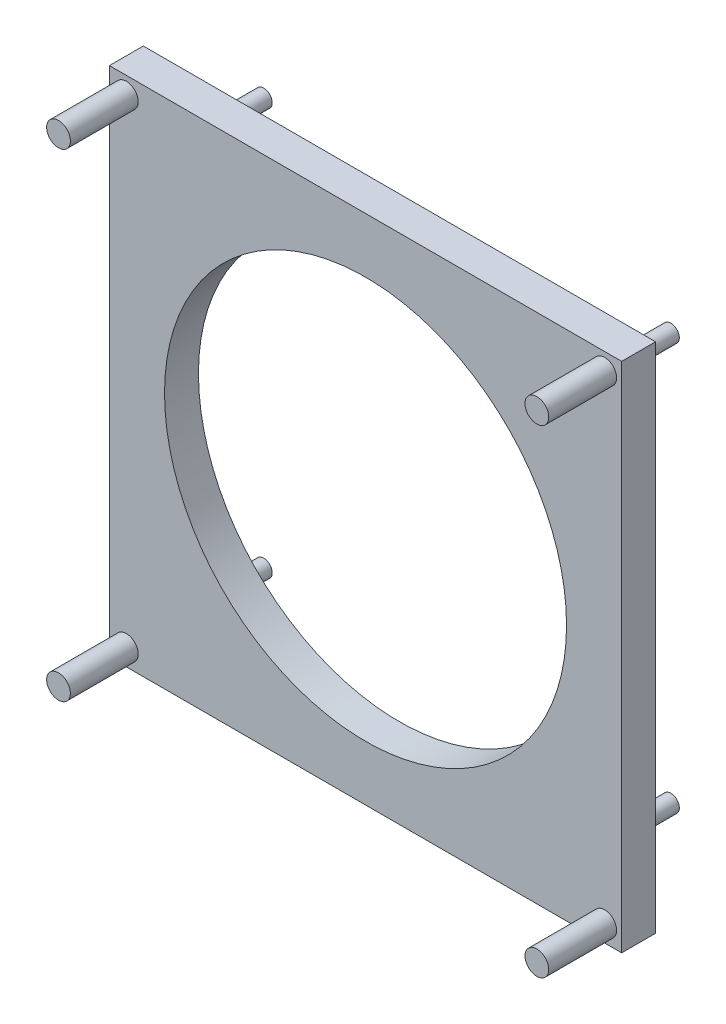
ISO-10303-21;
HEADER;
FILE_DESCRIPTION(('STEP AP214'),'2;1');
FILE_NAME('part.step','',(''),(''),'','','');
FILE_SCHEMA(('AUTOMOTIVE_DESIGN { 1 0 10303 214 1 1 1 1 }'));
ENDSEC;
DATA;
#1=APPLICATION_CONTEXT('core data for automotive mechanical design processes');
#2=APPLICATION_PROTOCOL_DEFINITION('international standard','automotive_design',2000,#1);
#3=PRODUCT_CONTEXT('',#1,'mechanical');
#4=PRODUCT('Part','Part','',(#3));
#5=PRODUCT_RELATED_PRODUCT_CATEGORY('part','',(#4));
#6=PRODUCT_DEFINITION_FORMATION('','',#4);
#7=PRODUCT_DEFINITION_CONTEXT('part definition',#1,'design');
#8=PRODUCT_DEFINITION('design','',#6,#7);
#9=PRODUCT_DEFINITION_SHAPE('','',#8);
#10=(LENGTH_UNIT() NAMED_UNIT(*) SI_UNIT(.MILLI.,.METRE.));
#11=(NAMED_UNIT(*) PLANE_ANGLE_UNIT() SI_UNIT($,.RADIAN.));
#12=(NAMED_UNIT(*) SI_UNIT($,.STERADIAN.) SOLID_ANGLE_UNIT());
#13=UNCERTAINTY_MEASURE_WITH_UNIT(LENGTH_MEASURE(1.E-05),#10,'distance_accuracy_value','');
#14=(GEOMETRIC_REPRESENTATION_CONTEXT(3) GLOBAL_UNCERTAINTY_ASSIGNED_CONTEXT((#13)) GLOBAL_UNIT_ASSIGNED_CONTEXT((#10,
#11,#12)) REPRESENTATION_CONTEXT('',''));
#15=CARTESIAN_POINT('',(0.,0.,0.));
#16=DIRECTION('',(0.,0.,1.));
#17=DIRECTION('',(1.,0.,0.));
#18=AXIS2_PLACEMENT_3D('',#15,#16,#17);
#19=CARTESIAN_POINT('',(-74.7582241985561,-22.7482461751393,0.));
#20=DIRECTION('',(0.,0.,1.));
#21=DIRECTION('',(1.,0.,0.));
#22=AXIS2_PLACEMENT_3D('',#19,#20,#21);
#23=PLANE('',#22);
#24=CARTESIAN_POINT('',(-210.258224198556,112.751753824861,0.));
#25=DIRECTION('',(0.,0.,1.));
#26=DIRECTION('',(1.,0.,0.));
#27=AXIS2_PLACEMENT_3D('',#24,#25,#26);
#28=CIRCLE('',#27,2.5);
#29=CARTESIAN_POINT('',(-207.758224198556,112.751753824861,0.));
#30=VERTEX_POINT('',#29);
#31=EDGE_CURVE('E42',#30,#30,#28,.F.);
#32=ORIENTED_EDGE('',*,*,#31,.F.);
#33=EDGE_LOOP('',(#32));
#34=FACE_BOUND('',#33,.T.);
#35=CARTESIAN_POINT('',(-90.258224198556,-7.24824617513933,0.));
#36=DIRECTION('',(0.,0.,1.));
#37=DIRECTION('',(1.,0.,0.));
#38=AXIS2_PLACEMENT_3D('',#35,#36,#37);
#39=CIRCLE('',#38,2.5);
#40=CARTESIAN_POINT('',(-87.758224198556,-7.24824617513933,0.));
#41=VERTEX_POINT('',#40);
#42=EDGE_CURVE('E112',#41,#41,#39,.F.);
#43=ORIENTED_EDGE('',*,*,#42,.F.);
#44=EDGE_LOOP('',(#43));
#45=FACE_BOUND('',#44,.T.);
#46=CARTESIAN_POINT('',(-150.258224198556,52.7517538248607,0.));
#47=DIRECTION('',(0.,0.,1.));
#48=DIRECTION('',(1.,0.,0.));
#49=AXIS2_PLACEMENT_3D('',#46,#47,#48);
#50=CIRCLE('',#49,59.25);
#51=CARTESIAN_POINT('',(-91.0082241985561,52.7517538248607,0.));
#52=VERTEX_POINT('',#51);
#53=EDGE_CURVE('E105',#52,#52,#50,.T.);
#54=ORIENTED_EDGE('',*,*,#53,.T.);
#55=EDGE_LOOP('',(#54));
#56=FACE_BOUND('',#55,.T.);
#57=DIRECTION('',(0.,1.,0.));
#58=VECTOR('',#57,1.);
#59=CARTESIAN_POINT('',(-74.7582241985561,128.251753824861,0.));
#60=LINE('',#59,#58);
#61=CARTESIAN_POINT('',(-74.758224198556,-22.7482461751393,0.));
#62=VERTEX_POINT('',#61);
#63=CARTESIAN_POINT('',(-74.7582241985561,128.251753824861,0.));
#64=VERTEX_POINT('',#63);
#65=EDGE_CURVE('E102',#62,#64,#60,.T.);
#66=ORIENTED_EDGE('',*,*,#65,.F.);
#67=DIRECTION('',(1.,0.,0.));
#68=VECTOR('',#67,1.);
#69=CARTESIAN_POINT('',(-225.758224198556,-22.7482461751393,0.));
#70=LINE('',#69,#68);
#71=CARTESIAN_POINT('',(-225.758224198556,-22.7482461751393,0.));
#72=VERTEX_POINT('',#71);
#73=EDGE_CURVE('E73',#72,#62,#70,.T.);
#74=ORIENTED_EDGE('',*,*,#73,.F.);
#75=DIRECTION('',(0.,-1.,0.));
#76=VECTOR('',#75,1.);
#77=CARTESIAN_POINT('',(-225.758224198556,128.251753824861,0.));
#78=LINE('',#77,#76);
#79=CARTESIAN_POINT('',(-225.758224198556,128.251753824861,0.));
#80=VERTEX_POINT('',#79);
#81=EDGE_CURVE('E67',#80,#72,#78,.T.);
#82=ORIENTED_EDGE('',*,*,#81,.F.);
#83=DIRECTION('',(-1.,0.,0.));
#84=VECTOR('',#83,1.);
#85=CARTESIAN_POINT('',(-225.758224198556,128.251753824861,0.));
#86=LINE('',#85,#84);
#87=EDGE_CURVE('E92',#64,#80,#86,.T.);
#88=ORIENTED_EDGE('',*,*,#87,.F.);
#89=EDGE_LOOP('',(#66,#74,#82,#88));
#90=FACE_BOUND('',#89,.T.);
#91=CARTESIAN_POINT('',(-90.258224198556,112.751753824861,0.));
#92=DIRECTION('',(0.,0.,1.));
#93=DIRECTION('',(1.,0.,0.));
#94=AXIS2_PLACEMENT_3D('',#91,#92,#93);
#95=CIRCLE('',#94,2.5);
#96=CARTESIAN_POINT('',(-87.758224198556,112.751753824861,0.));
#97=VERTEX_POINT('',#96);
#98=EDGE_CURVE('E115',#97,#97,#95,.F.);
#99=ORIENTED_EDGE('',*,*,#98,.F.);
#100=EDGE_LOOP('',(#99));
#101=FACE_BOUND('',#100,.T.);
#102=CARTESIAN_POINT('',(-210.258224198556,-7.24824617513932,0.));
#103=DIRECTION('',(0.,0.,1.));
#104=DIRECTION('',(1.,0.,0.));
#105=AXIS2_PLACEMENT_3D('',#102,#103,#104);
#106=CIRCLE('',#105,2.5);
#107=CARTESIAN_POINT('',(-207.758224198556,-7.24824617513932,0.));
#108=VERTEX_POINT('',#107);
#109=EDGE_CURVE('E11',#108,#108,#106,.F.);
#110=ORIENTED_EDGE('',*,*,#109,.F.);
#111=EDGE_LOOP('',(#110));
#112=FACE_BOUND('',#111,.T.);
#113=ADVANCED_FACE('F33',(#34,#45,#56,#90,#101,#112),#23,.F.);
#114=CARTESIAN_POINT('',(-74.7582241985561,-22.7482461751393,10.));
#115=DIRECTION('',(0.,0.,1.));
#116=DIRECTION('',(1.,0.,0.));
#117=AXIS2_PLACEMENT_3D('',#114,#115,#116);
#118=PLANE('',#117);
#119=CARTESIAN_POINT('',(-79.758224198556,123.251753824861,10.));
#120=DIRECTION('',(0.,0.,1.));
#121=DIRECTION('',(1.,0.,0.));
#122=AXIS2_PLACEMENT_3D('',#119,#120,#121);
#123=CIRCLE('',#122,3.50000000000001);
#124=CARTESIAN_POINT('',(-76.258224198556,123.251753824861,10.));
#125=VERTEX_POINT('',#124);
#126=EDGE_CURVE('E239',#125,#125,#123,.T.);
#127=ORIENTED_EDGE('',*,*,#126,.F.);
#128=EDGE_LOOP('',(#127));
#129=FACE_BOUND('',#128,.T.);
#130=CARTESIAN_POINT('',(-79.758224198556,-17.7482461751393,10.));
#131=DIRECTION('',(0.,0.,1.));
#132=DIRECTION('',(1.,0.,0.));
#133=AXIS2_PLACEMENT_3D('',#130,#131,#132);
#134=CIRCLE('',#133,3.50000000000001);
#135=CARTESIAN_POINT('',(-76.258224198556,-17.7482461751393,10.));
#136=VERTEX_POINT('',#135);
#137=EDGE_CURVE('E227',#136,#136,#134,.T.);
#138=ORIENTED_EDGE('',*,*,#137,.F.);
#139=EDGE_LOOP('',(#138));
#140=FACE_BOUND('',#139,.T.);
#141=CARTESIAN_POINT('',(-150.258224198556,52.7517538248607,10.));
#142=DIRECTION('',(0.,0.,1.));
#143=DIRECTION('',(1.,0.,0.));
#144=AXIS2_PLACEMENT_3D('',#141,#142,#143);
#145=CIRCLE('',#144,59.25);
#146=CARTESIAN_POINT('',(-91.0082241985561,52.7517538248607,10.));
#147=VERTEX_POINT('',#146);
#148=EDGE_CURVE('E222',#147,#147,#145,.T.);
#149=ORIENTED_EDGE('',*,*,#148,.F.);
#150=EDGE_LOOP('',(#149));
#151=FACE_BOUND('',#150,.T.);
#152=DIRECTION('',(0.,1.,0.));
#153=VECTOR('',#152,1.);
#154=CARTESIAN_POINT('',(-74.7582241985561,128.251753824861,10.));
#155=LINE('',#154,#153);
#156=CARTESIAN_POINT('',(-74.758224198556,-22.7482461751393,10.));
#157=VERTEX_POINT('',#156);
#158=CARTESIAN_POINT('',(-74.7582241985561,128.251753824861,10.));
#159=VERTEX_POINT('',#158);
#160=EDGE_CURVE('E87',#157,#159,#155,.T.);
#161=ORIENTED_EDGE('',*,*,#160,.T.);
#162=DIRECTION('',(-1.,0.,0.));
#163=VECTOR('',#162,1.);
#164=CARTESIAN_POINT('',(-225.758224198556,128.251753824861,10.));
#165=LINE('',#164,#163);
#166=CARTESIAN_POINT('',(-225.758224198556,128.251753824861,10.));
#167=VERTEX_POINT('',#166);
#168=EDGE_CURVE('E81',#159,#167,#165,.T.);
#169=ORIENTED_EDGE('',*,*,#168,.T.);
#170=DIRECTION('',(0.,-1.,0.));
#171=VECTOR('',#170,1.);
#172=CARTESIAN_POINT('',(-225.758224198556,128.251753824861,10.));
#173=LINE('',#172,#171);
#174=CARTESIAN_POINT('',(-225.758224198556,-22.7482461751393,10.));
#175=VERTEX_POINT('',#174);
#176=EDGE_CURVE('E85',#167,#175,#173,.T.);
#177=ORIENTED_EDGE('',*,*,#176,.T.);
#178=DIRECTION('',(1.,0.,0.));
#179=VECTOR('',#178,1.);
#180=CARTESIAN_POINT('',(-225.758224198556,-22.7482461751393,10.));
#181=LINE('',#180,#179);
#182=EDGE_CURVE('E50',#175,#157,#181,.T.);
#183=ORIENTED_EDGE('',*,*,#182,.T.);
#184=EDGE_LOOP('',(#161,#169,#177,#183));
#185=FACE_BOUND('',#184,.T.);
#186=CARTESIAN_POINT('',(-220.758224198556,-17.7482461751393,10.));
#187=DIRECTION('',(0.,0.,1.));
#188=DIRECTION('',(1.,0.,0.));
#189=AXIS2_PLACEMENT_3D('',#186,#187,#188);
#190=CIRCLE('',#189,3.49999999999999);
#191=CARTESIAN_POINT('',(-217.258224198556,-17.7482461751393,10.));
#192=VERTEX_POINT('',#191);
#193=EDGE_CURVE('E233',#192,#192,#190,.T.);
#194=ORIENTED_EDGE('',*,*,#193,.F.);
#195=EDGE_LOOP('',(#194));
#196=FACE_BOUND('',#195,.T.);
#197=CARTESIAN_POINT('',(-220.758224198556,123.251753824861,10.));
#198=DIRECTION('',(0.,0.,1.));
#199=DIRECTION('',(1.,0.,0.));
#200=AXIS2_PLACEMENT_3D('',#197,#198,#199);
#201=CIRCLE('',#200,3.49999999999999);
#202=CARTESIAN_POINT('',(-217.258224198556,123.251753824861,10.));
#203=VERTEX_POINT('',#202);
#204=EDGE_CURVE('E245',#203,#203,#201,.T.);
#205=ORIENTED_EDGE('',*,*,#204,.F.);
#206=EDGE_LOOP('',(#205));
#207=FACE_BOUND('',#206,.T.);
#208=ADVANCED_FACE('F82',(#129,#140,#151,#185,#196,#207),#118,.T.);
#209=CARTESIAN_POINT('',(-74.7582241985561,128.251753824861,10.));
#210=DIRECTION('',(-1.,0.,0.));
#211=DIRECTION('',(0.,-1.,0.));
#212=AXIS2_PLACEMENT_3D('',#209,#210,#211);
#213=PLANE('',#212);
#214=ORIENTED_EDGE('',*,*,#65,.T.);
#215=DIRECTION('',(0.,0.,-1.));
#216=VECTOR('',#215,1.);
#217=CARTESIAN_POINT('',(-74.7582241985561,128.251753824861,10.));
#218=LINE('',#217,#216);
#219=EDGE_CURVE('E93',#159,#64,#218,.T.);
#220=ORIENTED_EDGE('',*,*,#219,.F.);
#221=ORIENTED_EDGE('',*,*,#160,.F.);
#222=DIRECTION('',(0.,0.,-1.));
#223=VECTOR('',#222,1.);
#224=CARTESIAN_POINT('',(-74.758224198556,-22.7482461751393,10.));
#225=LINE('',#224,#223);
#226=EDGE_CURVE('E98',#157,#62,#225,.T.);
#227=ORIENTED_EDGE('',*,*,#226,.T.);
#228=EDGE_LOOP('',(#214,#220,#221,#227));
#229=FACE_BOUND('',#228,.T.);
#230=ADVANCED_FACE('F35',(#229),#213,.F.);
#231=CARTESIAN_POINT('',(-225.758224198556,128.251753824861,10.));
#232=DIRECTION('',(0.,-1.,0.));
#233=DIRECTION('',(0.,0.,-1.));
#234=AXIS2_PLACEMENT_3D('',#231,#232,#233);
#235=PLANE('',#234);
#236=ORIENTED_EDGE('',*,*,#87,.T.);
#237=DIRECTION('',(0.,0.,-1.));
#238=VECTOR('',#237,1.);
#239=CARTESIAN_POINT('',(-225.758224198556,128.251753824861,10.));
#240=LINE('',#239,#238);
#241=EDGE_CURVE('E90',#167,#80,#240,.T.);
#242=ORIENTED_EDGE('',*,*,#241,.F.);
#243=ORIENTED_EDGE('',*,*,#168,.F.);
#244=ORIENTED_EDGE('',*,*,#219,.T.);
#245=EDGE_LOOP('',(#236,#242,#243,#244));
#246=FACE_BOUND('',#245,.T.);
#247=ADVANCED_FACE('F91',(#246),#235,.F.);
#248=CARTESIAN_POINT('',(-225.758224198556,128.251753824861,10.));
#249=DIRECTION('',(1.,0.,0.));
#250=DIRECTION('',(0.,0.,-1.));
#251=AXIS2_PLACEMENT_3D('',#248,#249,#250);
#252=PLANE('',#251);
#253=ORIENTED_EDGE('',*,*,#81,.T.);
#254=DIRECTION('',(0.,0.,-1.));
#255=VECTOR('',#254,1.);
#256=CARTESIAN_POINT('',(-225.758224198556,-22.7482461751393,10.));
#257=LINE('',#256,#255);
#258=EDGE_CURVE('E94',#175,#72,#257,.T.);
#259=ORIENTED_EDGE('',*,*,#258,.F.);
#260=ORIENTED_EDGE('',*,*,#176,.F.);
#261=ORIENTED_EDGE('',*,*,#241,.T.);
#262=EDGE_LOOP('',(#253,#259,#260,#261));
#263=FACE_BOUND('',#262,.T.);
#264=ADVANCED_FACE('F96',(#263),#252,.F.);
#265=CARTESIAN_POINT('',(-225.758224198556,-22.7482461751393,10.));
#266=DIRECTION('',(0.,1.,0.));
#267=DIRECTION('',(0.,0.,1.));
#268=AXIS2_PLACEMENT_3D('',#265,#266,#267);
#269=PLANE('',#268);
#270=ORIENTED_EDGE('',*,*,#73,.T.);
#271=ORIENTED_EDGE('',*,*,#226,.F.);
#272=ORIENTED_EDGE('',*,*,#182,.F.);
#273=ORIENTED_EDGE('',*,*,#258,.T.);
#274=EDGE_LOOP('',(#270,#271,#272,#273));
#275=FACE_BOUND('',#274,.T.);
#276=ADVANCED_FACE('F206',(#275),#269,.F.);
#277=CARTESIAN_POINT('',(-150.258224198556,52.7517538248607,0.));
#278=DIRECTION('',(0.,0.,1.));
#279=DIRECTION('',(1.,0.,0.));
#280=AXIS2_PLACEMENT_3D('',#277,#278,#279);
#281=CYLINDRICAL_SURFACE('',#280,59.25);
#282=ORIENTED_EDGE('',*,*,#53,.F.);
#283=EDGE_LOOP('',(#282));
#284=FACE_BOUND('',#283,.T.);
#285=ORIENTED_EDGE('',*,*,#148,.T.);
#286=EDGE_LOOP('',(#285));
#287=FACE_BOUND('',#286,.T.);
#288=ADVANCED_FACE('F202',(#284,#287),#281,.F.);
#289=CARTESIAN_POINT('',(-79.758224198556,-17.7482461751393,30.));
#290=DIRECTION('',(0.,0.,-1.));
#291=DIRECTION('',(-1.,0.,0.));
#292=AXIS2_PLACEMENT_3D('',#289,#290,#291);
#293=CYLINDRICAL_SURFACE('',#292,3.50000000000001);
#294=CARTESIAN_POINT('',(-79.758224198556,-17.7482461751393,30.));
#295=DIRECTION('',(0.,0.,1.));
#296=DIRECTION('',(1.,0.,0.));
#297=AXIS2_PLACEMENT_3D('',#294,#295,#296);
#298=CIRCLE('',#297,3.50000000000001);
#299=CARTESIAN_POINT('',(-76.258224198556,-17.7482461751393,30.));
#300=VERTEX_POINT('',#299);
#301=EDGE_CURVE('E225',#300,#300,#298,.T.);
#302=ORIENTED_EDGE('',*,*,#301,.F.);
#303=EDGE_LOOP('',(#302));
#304=FACE_BOUND('',#303,.T.);
#305=ORIENTED_EDGE('',*,*,#137,.T.);
#306=EDGE_LOOP('',(#305));
#307=FACE_BOUND('',#306,.T.);
#308=ADVANCED_FACE('F198',(#304,#307),#293,.T.);
#309=CARTESIAN_POINT('',(-79.758224198556,-17.7482461751393,30.));
#310=DIRECTION('',(0.,0.,1.));
#311=DIRECTION('',(1.,0.,0.));
#312=AXIS2_PLACEMENT_3D('',#309,#310,#311);
#313=PLANE('',#312);
#314=ORIENTED_EDGE('',*,*,#301,.T.);
#315=EDGE_LOOP('',(#314));
#316=FACE_BOUND('',#315,.T.);
#317=ADVANCED_FACE('F194',(#316),#313,.T.);
#318=CARTESIAN_POINT('',(-220.758224198556,-17.7482461751393,30.));
#319=DIRECTION('',(0.,0.,-1.));
#320=DIRECTION('',(-1.,0.,0.));
#321=AXIS2_PLACEMENT_3D('',#318,#319,#320);
#322=CYLINDRICAL_SURFACE('',#321,3.49999999999999);
#323=CARTESIAN_POINT('',(-220.758224198556,-17.7482461751393,30.));
#324=DIRECTION('',(0.,0.,1.));
#325=DIRECTION('',(1.,0.,0.));
#326=AXIS2_PLACEMENT_3D('',#323,#324,#325);
#327=CIRCLE('',#326,3.49999999999999);
#328=CARTESIAN_POINT('',(-217.258224198556,-17.7482461751393,30.));
#329=VERTEX_POINT('',#328);
#330=EDGE_CURVE('E230',#329,#329,#327,.T.);
#331=ORIENTED_EDGE('',*,*,#330,.F.);
#332=EDGE_LOOP('',(#331));
#333=FACE_BOUND('',#332,.T.);
#334=ORIENTED_EDGE('',*,*,#193,.T.);
#335=EDGE_LOOP('',(#334));
#336=FACE_BOUND('',#335,.T.);
#337=ADVANCED_FACE('F190',(#333,#336),#322,.T.);
#338=CARTESIAN_POINT('',(-220.758224198556,-17.7482461751393,30.));
#339=DIRECTION('',(0.,0.,1.));
#340=DIRECTION('',(1.,0.,0.));
#341=AXIS2_PLACEMENT_3D('',#338,#339,#340);
#342=PLANE('',#341);
#343=ORIENTED_EDGE('',*,*,#330,.T.);
#344=EDGE_LOOP('',(#343));
#345=FACE_BOUND('',#344,.T.);
#346=ADVANCED_FACE('F186',(#345),#342,.T.);
#347=CARTESIAN_POINT('',(-79.758224198556,123.251753824861,30.));
#348=DIRECTION('',(0.,0.,-1.));
#349=DIRECTION('',(-1.,0.,0.));
#350=AXIS2_PLACEMENT_3D('',#347,#348,#349);
#351=CYLINDRICAL_SURFACE('',#350,3.50000000000001);
#352=CARTESIAN_POINT('',(-79.758224198556,123.251753824861,30.));
#353=DIRECTION('',(0.,0.,1.));
#354=DIRECTION('',(1.,0.,0.));
#355=AXIS2_PLACEMENT_3D('',#352,#353,#354);
#356=CIRCLE('',#355,3.50000000000001);
#357=CARTESIAN_POINT('',(-76.258224198556,123.251753824861,30.));
#358=VERTEX_POINT('',#357);
#359=EDGE_CURVE('E236',#358,#358,#356,.T.);
#360=ORIENTED_EDGE('',*,*,#359,.F.);
#361=EDGE_LOOP('',(#360));
#362=FACE_BOUND('',#361,.T.);
#363=ORIENTED_EDGE('',*,*,#126,.T.);
#364=EDGE_LOOP('',(#363));
#365=FACE_BOUND('',#364,.T.);
#366=ADVANCED_FACE('F182',(#362,#365),#351,.T.);
#367=CARTESIAN_POINT('',(-79.758224198556,123.251753824861,30.));
#368=DIRECTION('',(0.,0.,1.));
#369=DIRECTION('',(1.,0.,0.));
#370=AXIS2_PLACEMENT_3D('',#367,#368,#369);
#371=PLANE('',#370);
#372=ORIENTED_EDGE('',*,*,#359,.T.);
#373=EDGE_LOOP('',(#372));
#374=FACE_BOUND('',#373,.T.);
#375=ADVANCED_FACE('F178',(#374),#371,.T.);
#376=CARTESIAN_POINT('',(-220.758224198556,123.251753824861,30.));
#377=DIRECTION('',(0.,0.,-1.));
#378=DIRECTION('',(-1.,0.,0.));
#379=AXIS2_PLACEMENT_3D('',#376,#377,#378);
#380=CYLINDRICAL_SURFACE('',#379,3.49999999999999);
#381=CARTESIAN_POINT('',(-220.758224198556,123.251753824861,30.));
#382=DIRECTION('',(0.,0.,1.));
#383=DIRECTION('',(1.,0.,0.));
#384=AXIS2_PLACEMENT_3D('',#381,#382,#383);
#385=CIRCLE('',#384,3.49999999999999);
#386=CARTESIAN_POINT('',(-217.258224198556,123.251753824861,30.));
#387=VERTEX_POINT('',#386);
#388=EDGE_CURVE('E242',#387,#387,#385,.T.);
#389=ORIENTED_EDGE('',*,*,#388,.F.);
#390=EDGE_LOOP('',(#389));
#391=FACE_BOUND('',#390,.T.);
#392=ORIENTED_EDGE('',*,*,#204,.T.);
#393=EDGE_LOOP('',(#392));
#394=FACE_BOUND('',#393,.T.);
#395=ADVANCED_FACE('F174',(#391,#394),#380,.T.);
#396=CARTESIAN_POINT('',(-220.758224198556,123.251753824861,30.));
#397=DIRECTION('',(0.,0.,1.));
#398=DIRECTION('',(1.,0.,0.));
#399=AXIS2_PLACEMENT_3D('',#396,#397,#398);
#400=PLANE('',#399);
#401=ORIENTED_EDGE('',*,*,#388,.T.);
#402=EDGE_LOOP('',(#401));
#403=FACE_BOUND('',#402,.T.);
#404=ADVANCED_FACE('F170',(#403),#400,.T.);
#405=CARTESIAN_POINT('',(-90.258224198556,-7.24824617513933,-20.));
#406=DIRECTION('',(0.,0.,1.));
#407=DIRECTION('',(1.,0.,0.));
#408=AXIS2_PLACEMENT_3D('',#405,#406,#407);
#409=CYLINDRICAL_SURFACE('',#408,2.5);
#410=CARTESIAN_POINT('',(-90.258224198556,-7.24824617513933,-20.));
#411=DIRECTION('',(0.,0.,-1.));
#412=DIRECTION('',(-1.,0.,0.));
#413=AXIS2_PLACEMENT_3D('',#410,#411,#412);
#414=CIRCLE('',#413,2.5);
#415=CARTESIAN_POINT('',(-92.758224198556,-7.24824617513933,-20.));
#416=VERTEX_POINT('',#415);
#417=EDGE_CURVE('E248',#416,#416,#414,.T.);
#418=ORIENTED_EDGE('',*,*,#417,.F.);
#419=EDGE_LOOP('',(#418));
#420=FACE_BOUND('',#419,.T.);
#421=ORIENTED_EDGE('',*,*,#42,.T.);
#422=EDGE_LOOP('',(#421));
#423=FACE_BOUND('',#422,.T.);
#424=ADVANCED_FACE('F166',(#420,#423),#409,.T.);
#425=CARTESIAN_POINT('',(-90.258224198556,-7.24824617513933,-20.));
#426=DIRECTION('',(0.,0.,-1.));
#427=DIRECTION('',(-1.,0.,0.));
#428=AXIS2_PLACEMENT_3D('',#425,#426,#427);
#429=PLANE('',#428);
#430=ORIENTED_EDGE('',*,*,#417,.T.);
#431=EDGE_LOOP('',(#430));
#432=FACE_BOUND('',#431,.T.);
#433=ADVANCED_FACE('F162',(#432),#429,.T.);
#434=CARTESIAN_POINT('',(-90.258224198556,112.751753824861,-20.));
#435=DIRECTION('',(0.,0.,1.));
#436=DIRECTION('',(1.,0.,0.));
#437=AXIS2_PLACEMENT_3D('',#434,#435,#436);
#438=CYLINDRICAL_SURFACE('',#437,2.5);
#439=CARTESIAN_POINT('',(-90.258224198556,112.751753824861,-20.));
#440=DIRECTION('',(0.,0.,-1.));
#441=DIRECTION('',(-1.,0.,0.));
#442=AXIS2_PLACEMENT_3D('',#439,#440,#441);
#443=CIRCLE('',#442,2.5);
#444=CARTESIAN_POINT('',(-92.758224198556,112.751753824861,-20.));
#445=VERTEX_POINT('',#444);
#446=EDGE_CURVE('E253',#445,#445,#443,.T.);
#447=ORIENTED_EDGE('',*,*,#446,.F.);
#448=EDGE_LOOP('',(#447));
#449=FACE_BOUND('',#448,.T.);
#450=ORIENTED_EDGE('',*,*,#98,.T.);
#451=EDGE_LOOP('',(#450));
#452=FACE_BOUND('',#451,.T.);
#453=ADVANCED_FACE('F158',(#449,#452),#438,.T.);
#454=CARTESIAN_POINT('',(-90.258224198556,112.751753824861,-20.));
#455=DIRECTION('',(0.,0.,-1.));
#456=DIRECTION('',(-1.,0.,0.));
#457=AXIS2_PLACEMENT_3D('',#454,#455,#456);
#458=PLANE('',#457);
#459=ORIENTED_EDGE('',*,*,#446,.T.);
#460=EDGE_LOOP('',(#459));
#461=FACE_BOUND('',#460,.T.);
#462=ADVANCED_FACE('F154',(#461),#458,.T.);
#463=CARTESIAN_POINT('',(-210.258224198556,112.751753824861,-20.));
#464=DIRECTION('',(0.,0.,1.));
#465=DIRECTION('',(1.,0.,0.));
#466=AXIS2_PLACEMENT_3D('',#463,#464,#465);
#467=CYLINDRICAL_SURFACE('',#466,2.5);
#468=CARTESIAN_POINT('',(-210.258224198556,112.751753824861,-20.));
#469=DIRECTION('',(0.,0.,-1.));
#470=DIRECTION('',(-1.,0.,0.));
#471=AXIS2_PLACEMENT_3D('',#468,#469,#470);
#472=CIRCLE('',#471,2.5);
#473=CARTESIAN_POINT('',(-212.758224198556,112.751753824861,-20.));
#474=VERTEX_POINT('',#473);
#475=EDGE_CURVE('E256',#474,#474,#472,.T.);
#476=ORIENTED_EDGE('',*,*,#475,.F.);
#477=EDGE_LOOP('',(#476));
#478=FACE_BOUND('',#477,.T.);
#479=ORIENTED_EDGE('',*,*,#31,.T.);
#480=EDGE_LOOP('',(#479));
#481=FACE_BOUND('',#480,.T.);
#482=ADVANCED_FACE('F120',(#478,#481),#467,.T.);
#483=CARTESIAN_POINT('',(-210.258224198556,112.751753824861,-20.));
#484=DIRECTION('',(0.,0.,-1.));
#485=DIRECTION('',(-1.,0.,0.));
#486=AXIS2_PLACEMENT_3D('',#483,#484,#485);
#487=PLANE('',#486);
#488=ORIENTED_EDGE('',*,*,#475,.T.);
#489=EDGE_LOOP('',(#488));
#490=FACE_BOUND('',#489,.T.);
#491=ADVANCED_FACE('F139',(#490),#487,.T.);
#492=CARTESIAN_POINT('',(-210.258224198556,-7.24824617513932,-20.));
#493=DIRECTION('',(0.,0.,1.));
#494=DIRECTION('',(1.,0.,0.));
#495=AXIS2_PLACEMENT_3D('',#492,#493,#494);
#496=CYLINDRICAL_SURFACE('',#495,2.5);
#497=CARTESIAN_POINT('',(-210.258224198556,-7.24824617513932,-20.));
#498=DIRECTION('',(0.,0.,-1.));
#499=DIRECTION('',(-1.,0.,0.));
#500=AXIS2_PLACEMENT_3D('',#497,#498,#499);
#501=CIRCLE('',#500,2.5);
#502=CARTESIAN_POINT('',(-212.758224198556,-7.24824617513932,-20.));
#503=VERTEX_POINT('',#502);
#504=EDGE_CURVE('E259',#503,#503,#501,.T.);
#505=ORIENTED_EDGE('',*,*,#504,.F.);
#506=EDGE_LOOP('',(#505));
#507=FACE_BOUND('',#506,.T.);
#508=ORIENTED_EDGE('',*,*,#109,.T.);
#509=EDGE_LOOP('',(#508));
#510=FACE_BOUND('',#509,.T.);
#511=ADVANCED_FACE('F136',(#507,#510),#496,.T.);
#512=CARTESIAN_POINT('',(-210.258224198556,-7.24824617513932,-20.));
#513=DIRECTION('',(0.,0.,-1.));
#514=DIRECTION('',(-1.,0.,0.));
#515=AXIS2_PLACEMENT_3D('',#512,#513,#514);
#516=PLANE('',#515);
#517=ORIENTED_EDGE('',*,*,#504,.T.);
#518=EDGE_LOOP('',(#517));
#519=FACE_BOUND('',#518,.T.);
#520=ADVANCED_FACE('F138',(#519),#516,.T.);
#521=CLOSED_SHELL('',(#113,#208,#230,#247,#264,#276,#288,#308,#317,#337,#346,#366,#375,#395,
#404,#424,#433,#453,#462,#482,#491,#511,#520));
#522=MANIFOLD_SOLID_BREP('B2',#521);
#523=ADVANCED_BREP_SHAPE_REPRESENTATION('',(#18,#522),#14);
#524=SHAPE_DEFINITION_REPRESENTATION(#9,#523);
ENDSEC;
END-ISO-10303-21;
